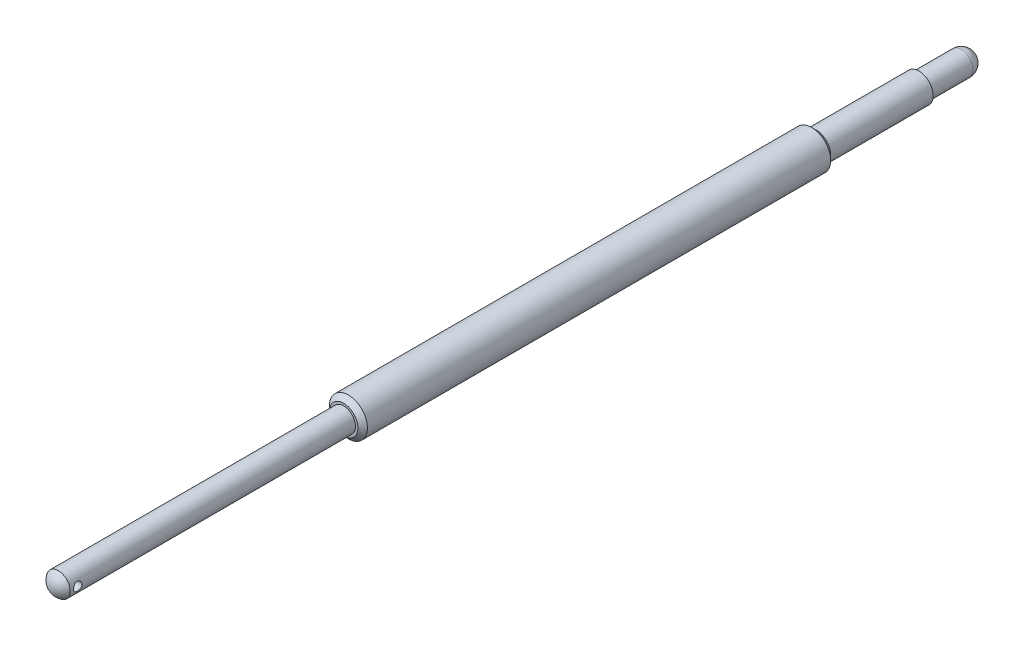
ISO-10303-21;
HEADER;
FILE_DESCRIPTION(('STEP AP214'),'2;1');
FILE_NAME('part.step','',(''),(''),'','','');
FILE_SCHEMA(('AUTOMOTIVE_DESIGN { 1 0 10303 214 1 1 1 1 }'));
ENDSEC;
DATA;
#1=APPLICATION_CONTEXT('core data for automotive mechanical design processes');
#2=APPLICATION_PROTOCOL_DEFINITION('international standard','automotive_design',2000,#1);
#3=PRODUCT_CONTEXT('',#1,'mechanical');
#4=PRODUCT('Part','Part','',(#3));
#5=PRODUCT_RELATED_PRODUCT_CATEGORY('part','',(#4));
#6=PRODUCT_DEFINITION_FORMATION('','',#4);
#7=PRODUCT_DEFINITION_CONTEXT('part definition',#1,'design');
#8=PRODUCT_DEFINITION('design','',#6,#7);
#9=PRODUCT_DEFINITION_SHAPE('','',#8);
#10=(LENGTH_UNIT() NAMED_UNIT(*) SI_UNIT(.MILLI.,.METRE.));
#11=(NAMED_UNIT(*) PLANE_ANGLE_UNIT() SI_UNIT($,.RADIAN.));
#12=(NAMED_UNIT(*) SI_UNIT($,.STERADIAN.) SOLID_ANGLE_UNIT());
#13=UNCERTAINTY_MEASURE_WITH_UNIT(LENGTH_MEASURE(1.E-05),#10,'distance_accuracy_value','');
#14=(GEOMETRIC_REPRESENTATION_CONTEXT(3) GLOBAL_UNCERTAINTY_ASSIGNED_CONTEXT((#13)) GLOBAL_UNIT_ASSIGNED_CONTEXT((#10,
#11,#12)) REPRESENTATION_CONTEXT('',''));
#15=CARTESIAN_POINT('',(0.,0.,0.));
#16=DIRECTION('',(0.,0.,1.));
#17=DIRECTION('',(1.,0.,0.));
#18=AXIS2_PLACEMENT_3D('',#15,#16,#17);
#19=CARTESIAN_POINT('',(0.,0.,29.2339285714286));
#20=DIRECTION('',(0.,0.,1.));
#21=DIRECTION('',(0.,1.,0.));
#22=AXIS2_PLACEMENT_3D('',#19,#20,#21);
#23=SPHERICAL_SURFACE('',#22,1.46607142857143);
#24=CARTESIAN_POINT('',(0.,0.,30.));
#25=DIRECTION('',(0.,0.,1.));
#26=DIRECTION('',(1.,0.,0.));
#27=AXIS2_PLACEMENT_3D('',#24,#25,#26);
#28=CIRCLE('',#27,1.25);
#29=CARTESIAN_POINT('',(1.25,0.,30.));
#30=VERTEX_POINT('',#29);
#31=EDGE_CURVE('E119',#30,#30,#28,.T.);
#32=ORIENTED_EDGE('',*,*,#31,.T.);
#33=EDGE_LOOP('',(#32));
#34=FACE_BOUND('',#33,.T.);
#35=ADVANCED_FACE('F37',(#34),#23,.T.);
#36=CARTESIAN_POINT('',(0.,0.,29.2339285714286));
#37=DIRECTION('',(0.,0.,1.));
#38=DIRECTION('',(1.,0.,0.));
#39=AXIS2_PLACEMENT_3D('',#36,#37,#38);
#40=CYLINDRICAL_SURFACE('',#39,1.25);
#41=CARTESIAN_POINT('',(1.25,0.,28.75));
#42=CARTESIAN_POINT('',(1.25000040723609,0.0244384751305164,28.7499994378276));
#43=CARTESIAN_POINT('',(1.24927693383174,0.0488729671488299,28.7519971248668));
#44=CARTESIAN_POINT('',(1.24646274613068,0.0970155173121452,28.7599057238524));
#45=CARTESIAN_POINT('',(1.24437210730604,0.120723615480875,28.7658164197878));
#46=CARTESIAN_POINT('',(1.23904903698493,0.166712324204668,28.7813174820519));
#47=CARTESIAN_POINT('',(1.23581870141066,0.188995467013132,28.7909010965917));
#48=CARTESIAN_POINT('',(1.22854090572765,0.231637065109007,28.8134430273575));
#49=CARTESIAN_POINT('',(1.2244932459972,0.251995048412089,28.8264021682404));
#50=CARTESIAN_POINT('',(1.21582249643607,0.291014704761408,28.8558644937571));
#51=CARTESIAN_POINT('',(1.2111840215262,0.309589863296305,28.8724776929282));
#52=CARTESIAN_POINT('',(1.20193335622081,0.343758835001425,28.9085429224733));
#53=CARTESIAN_POINT('',(1.19732117331175,0.359351836506441,28.9279957231797));
#54=CARTESIAN_POINT('',(1.18846998956649,0.387642687096019,28.9700083602702));
#55=CARTESIAN_POINT('',(1.18424937262762,0.400221982066126,28.9926522853473));
#56=CARTESIAN_POINT('',(1.17689655449398,0.421355714195511,29.0399105234912));
#57=CARTESIAN_POINT('',(1.17376395734842,0.429911615945029,29.0645241157384));
#58=CARTESIAN_POINT('',(1.16910541230589,0.442420401266971,29.1140309519151));
#59=CARTESIAN_POINT('',(1.16752240955865,0.446537363083646,29.1388771967946));
#60=CARTESIAN_POINT('',(1.16597459854696,0.450564482723503,29.1889543985149));
#61=CARTESIAN_POINT('',(1.1660091875151,0.450476207554875,29.2141852085505));
#62=CARTESIAN_POINT('',(1.16764315768912,0.44622152848196,29.2628536380879));
#63=CARTESIAN_POINT('',(1.16915721360065,0.442277492025171,29.286314080389));
#64=CARTESIAN_POINT('',(1.17343853021116,0.430789047499055,29.3322146765749));
#65=CARTESIAN_POINT('',(1.17620596479969,0.423244139849115,29.3546546884131));
#66=CARTESIAN_POINT('',(1.18273701623024,0.40463750761211,29.3983497926454));
#67=CARTESIAN_POINT('',(1.18651761729747,0.393515107315717,29.4195763978732));
#68=CARTESIAN_POINT('',(1.19464282278517,0.368111414259556,29.4599285988523));
#69=CARTESIAN_POINT('',(1.19898761055485,0.353829093523208,29.4790535078482));
#70=CARTESIAN_POINT('',(1.20807814726778,0.321474819154318,29.5158975383794));
#71=CARTESIAN_POINT('',(1.21283211547681,0.303223719437381,29.5334576783276));
#72=CARTESIAN_POINT('',(1.22197397595828,0.263979327970811,29.5653131732553));
#73=CARTESIAN_POINT('',(1.22636182040125,0.242985678857932,29.5796081020985));
#74=CARTESIAN_POINT('',(1.23435250383743,0.19847222797816,29.604684585905));
#75=CARTESIAN_POINT('',(1.23794416956984,0.174922636894472,29.6154170721114));
#76=CARTESIAN_POINT('',(1.24385568150711,0.126191129580164,29.6327164670057));
#77=CARTESIAN_POINT('',(1.24617604643873,0.101009883807999,29.639285074846));
#78=CARTESIAN_POINT('',(1.24919427583536,0.0510708468532371,29.647773601373));
#79=CARTESIAN_POINT('',(1.2499668844348,0.0263539673298414,29.6499078679819));
#80=CARTESIAN_POINT('',(1.25003098979485,-0.0230937505797712,29.6500862270546));
#81=CARTESIAN_POINT('',(1.2493227848467,-0.047824585151678,29.6481311432666));
#82=CARTESIAN_POINT('',(1.2465542310084,-0.0956974939355514,29.6403519031709));
#83=CARTESIAN_POINT('',(1.24454182742962,-0.118864903840725,29.6346648526896));
#84=CARTESIAN_POINT('',(1.23941514105771,-0.163903161679207,29.6197602295643));
#85=CARTESIAN_POINT('',(1.23630071506999,-0.185773840686505,29.6105421980989));
#86=CARTESIAN_POINT('',(1.22917069302151,-0.228292725849061,29.5885506218013));
#87=CARTESIAN_POINT('',(1.22513200678827,-0.248888543421395,29.5756834979693));
#88=CARTESIAN_POINT('',(1.21660467864307,-0.287695056299308,29.5468661825303));
#89=CARTESIAN_POINT('',(1.21211588067868,-0.305904919319065,29.5309149198698));
#90=CARTESIAN_POINT('',(1.20288780701601,-0.340437159411125,29.4953785877642));
#91=CARTESIAN_POINT('',(1.19814794682364,-0.35660696997101,29.4756450354927));
#92=CARTESIAN_POINT('',(1.18918923503224,-0.38543156016825,29.4336474342942));
#93=CARTESIAN_POINT('',(1.18497041195522,-0.398086147426711,29.4113832469661));
#94=CARTESIAN_POINT('',(1.17755963771346,-0.419502848931232,29.3648457172156));
#95=CARTESIAN_POINT('',(1.1743692500569,-0.428259044165972,29.3405693855468));
#96=CARTESIAN_POINT('',(1.16945344897398,-0.441508257865328,29.290741749571));
#97=CARTESIAN_POINT('',(1.1677272245445,-0.446003636567572,29.265191159394));
#98=CARTESIAN_POINT('',(1.16603733274694,-0.450401984829263,29.215178619576));
#99=CARTESIAN_POINT('',(1.16597482910249,-0.45056248443227,29.1907424458759));
#100=CARTESIAN_POINT('',(1.16736938466223,-0.446936699788748,29.1422111944486));
#101=CARTESIAN_POINT('',(1.16882632183067,-0.443150732507562,29.1181160894857));
#102=CARTESIAN_POINT('',(1.17301639751018,-0.431933687101611,29.0715802480714));
#103=CARTESIAN_POINT('',(1.17571550830545,-0.42459954784184,29.0491128276829));
#104=CARTESIAN_POINT('',(1.18206854191781,-0.406576951210559,29.0057123940045));
#105=CARTESIAN_POINT('',(1.18572269641268,-0.395887679812983,28.9847797546068));
#106=CARTESIAN_POINT('',(1.19379853976348,-0.370845022792183,28.9439217257789));
#107=CARTESIAN_POINT('',(1.198249198894,-0.356336898192084,28.9240969625188));
#108=CARTESIAN_POINT('',(1.20730930678499,-0.324315932234132,28.887080717396));
#109=CARTESIAN_POINT('',(1.21191880360763,-0.306802174916689,28.8698900412971));
#110=CARTESIAN_POINT('',(1.2210444364961,-0.268254928538434,28.8377872794059));
#111=CARTESIAN_POINT('',(1.22554532818551,-0.247092356574388,28.8230252189189));
#112=CARTESIAN_POINT('',(1.23370833099967,-0.202431213302635,28.7972770446774));
#113=CARTESIAN_POINT('',(1.23737048592701,-0.178932764076829,28.7862907337213));
#114=CARTESIAN_POINT('',(1.24346891087715,-0.129994305064539,28.7683903149976));
#115=CARTESIAN_POINT('',(1.24589215034614,-0.104536772886705,28.7615193674));
#116=CARTESIAN_POINT('',(1.24915715403535,-0.0527177016926036,28.7523254369654));
#117=CARTESIAN_POINT('',(1.24999956080189,-0.0263565344068856,28.7500006062947));
#118=CARTESIAN_POINT('',(1.25,0.,28.75));
#119=B_SPLINE_CURVE_WITH_KNOTS('',3,(#41,#42,#43,#44,#45,#46,#47,#48,#49,#50,#51,#52,#53,#54,
#55,#56,#57,#58,#59,#60,#61,#62,#63,#64,#65,#66,#67,#68,#69,#70,#71,#72,#73,#74,#75,#76,#77,#78,
#79,#80,#81,#82,#83,#84,#85,#86,#87,#88,#89,#90,#91,#92,#93,#94,#95,#96,#97,#98,#99,#100,#101,
#102,#103,#104,#105,#106,#107,#108,#109,#110,#111,#112,#113,#114,#115,#116,#117,#118),
.UNSPECIFIED.,.T.,.F.,(4,2,2,2,2,2,2,2,2,2,2,2,2,2,2,2,2,2,2,2,2,2,2,2,2,2,2,2,2,2,2,2,2,2,2,2,
2,2,4),(0.,0.0732182893614255,0.146432537171328,0.21951283856027,0.292611010580062,
0.36831902379005,0.444047613509014,0.522390971103224,0.600705788134358,0.676014536012452,
0.751295221619205,0.822475923261536,0.893666503302356,0.966134511965872,1.03862613047689,
1.11557965661002,1.19254322006218,1.2705266871562,1.34847831104277,1.42256484554476,
1.49663645768572,1.56812863156829,1.63963009841392,1.71316308695476,1.78672165789763,
1.86420534315489,1.94169326805466,2.01929844659833,2.09686061134522,2.16980407149288,
2.24274167354818,2.31379036584246,2.38485630939515,2.45942793642934,2.53402232948025,
2.61221708320134,2.69040775231132,2.76940471187616,2.84836955532329),.UNSPECIFIED.);
#120=CARTESIAN_POINT('',(1.25,0.,28.75));
#121=VERTEX_POINT('',#120);
#122=EDGE_CURVE('E41',#121,#121,#119,.T.);
#123=ORIENTED_EDGE('',*,*,#122,.F.);
#124=EDGE_LOOP('',(#123));
#125=FACE_BOUND('',#124,.T.);
#126=CARTESIAN_POINT('',(-1.25,0.,28.75));
#127=CARTESIAN_POINT('',(-1.25000040723609,-0.0244384751305164,28.7499994378276));
#128=CARTESIAN_POINT('',(-1.24927693383174,-0.0488729671488299,28.7519971248668));
#129=CARTESIAN_POINT('',(-1.24646274613068,-0.0970155173121452,28.7599057238524));
#130=CARTESIAN_POINT('',(-1.24437210730604,-0.120723615480875,28.7658164197878));
#131=CARTESIAN_POINT('',(-1.23904903698493,-0.166712324204668,28.7813174820519));
#132=CARTESIAN_POINT('',(-1.23581870141066,-0.188995467013132,28.7909010965917));
#133=CARTESIAN_POINT('',(-1.22854090572765,-0.231637065109007,28.8134430273575));
#134=CARTESIAN_POINT('',(-1.2244932459972,-0.251995048412089,28.8264021682404));
#135=CARTESIAN_POINT('',(-1.21582249643607,-0.291014704761408,28.8558644937571));
#136=CARTESIAN_POINT('',(-1.2111840215262,-0.309589863296305,28.8724776929282));
#137=CARTESIAN_POINT('',(-1.20193335622081,-0.343758835001425,28.9085429224733));
#138=CARTESIAN_POINT('',(-1.19732117331175,-0.359351836506441,28.9279957231797));
#139=CARTESIAN_POINT('',(-1.18846998956649,-0.387642687096019,28.9700083602702));
#140=CARTESIAN_POINT('',(-1.18424937262762,-0.400221982066126,28.9926522853473));
#141=CARTESIAN_POINT('',(-1.17689655449398,-0.421355714195511,29.0399105234912));
#142=CARTESIAN_POINT('',(-1.17376395734842,-0.429911615945029,29.0645241157384));
#143=CARTESIAN_POINT('',(-1.16910541230589,-0.442420401266971,29.1140309519151));
#144=CARTESIAN_POINT('',(-1.16752240955865,-0.446537363083646,29.1388771967946));
#145=CARTESIAN_POINT('',(-1.16597459854696,-0.450564482723503,29.1889543985149));
#146=CARTESIAN_POINT('',(-1.1660091875151,-0.450476207554875,29.2141852085505));
#147=CARTESIAN_POINT('',(-1.16764315768912,-0.44622152848196,29.2628536380879));
#148=CARTESIAN_POINT('',(-1.16915721360065,-0.442277492025171,29.286314080389));
#149=CARTESIAN_POINT('',(-1.17343853021116,-0.430789047499055,29.3322146765749));
#150=CARTESIAN_POINT('',(-1.17620596479969,-0.423244139849115,29.3546546884131));
#151=CARTESIAN_POINT('',(-1.18273701623024,-0.40463750761211,29.3983497926454));
#152=CARTESIAN_POINT('',(-1.18651761729747,-0.393515107315717,29.4195763978732));
#153=CARTESIAN_POINT('',(-1.19464282278517,-0.368111414259556,29.4599285988523));
#154=CARTESIAN_POINT('',(-1.19898761055485,-0.353829093523208,29.4790535078482));
#155=CARTESIAN_POINT('',(-1.20807814726778,-0.321474819154318,29.5158975383794));
#156=CARTESIAN_POINT('',(-1.21283211547681,-0.303223719437381,29.5334576783276));
#157=CARTESIAN_POINT('',(-1.22197397595828,-0.263979327970811,29.5653131732553));
#158=CARTESIAN_POINT('',(-1.22636182040125,-0.242985678857932,29.5796081020985));
#159=CARTESIAN_POINT('',(-1.23435250383743,-0.19847222797816,29.604684585905));
#160=CARTESIAN_POINT('',(-1.23794416956984,-0.174922636894472,29.6154170721114));
#161=CARTESIAN_POINT('',(-1.24385568150711,-0.126191129580164,29.6327164670057));
#162=CARTESIAN_POINT('',(-1.24617604643873,-0.101009883807999,29.639285074846));
#163=CARTESIAN_POINT('',(-1.24919427583536,-0.0510708468532371,29.647773601373));
#164=CARTESIAN_POINT('',(-1.2499668844348,-0.0263539673298414,29.6499078679819));
#165=CARTESIAN_POINT('',(-1.25003098979485,0.0230937505797712,29.6500862270546));
#166=CARTESIAN_POINT('',(-1.2493227848467,0.047824585151678,29.6481311432666));
#167=CARTESIAN_POINT('',(-1.2465542310084,0.0956974939355514,29.6403519031709));
#168=CARTESIAN_POINT('',(-1.24454182742962,0.118864903840725,29.6346648526896));
#169=CARTESIAN_POINT('',(-1.23941514105771,0.163903161679207,29.6197602295643));
#170=CARTESIAN_POINT('',(-1.23630071506999,0.185773840686505,29.6105421980989));
#171=CARTESIAN_POINT('',(-1.22917069302151,0.228292725849061,29.5885506218013));
#172=CARTESIAN_POINT('',(-1.22513200678827,0.248888543421395,29.5756834979693));
#173=CARTESIAN_POINT('',(-1.21660467864307,0.287695056299308,29.5468661825303));
#174=CARTESIAN_POINT('',(-1.21211588067868,0.305904919319065,29.5309149198698));
#175=CARTESIAN_POINT('',(-1.20288780701601,0.340437159411125,29.4953785877642));
#176=CARTESIAN_POINT('',(-1.19814794682364,0.35660696997101,29.4756450354927));
#177=CARTESIAN_POINT('',(-1.18918923503224,0.38543156016825,29.4336474342942));
#178=CARTESIAN_POINT('',(-1.18497041195522,0.398086147426711,29.4113832469661));
#179=CARTESIAN_POINT('',(-1.17755963771346,0.419502848931232,29.3648457172156));
#180=CARTESIAN_POINT('',(-1.1743692500569,0.428259044165972,29.3405693855468));
#181=CARTESIAN_POINT('',(-1.16945344897398,0.441508257865328,29.290741749571));
#182=CARTESIAN_POINT('',(-1.1677272245445,0.446003636567572,29.265191159394));
#183=CARTESIAN_POINT('',(-1.16603733274694,0.450401984829263,29.215178619576));
#184=CARTESIAN_POINT('',(-1.16597482910249,0.45056248443227,29.1907424458759));
#185=CARTESIAN_POINT('',(-1.16736938466223,0.446936699788748,29.1422111944486));
#186=CARTESIAN_POINT('',(-1.16882632183067,0.443150732507562,29.1181160894857));
#187=CARTESIAN_POINT('',(-1.17301639751018,0.431933687101611,29.0715802480714));
#188=CARTESIAN_POINT('',(-1.17571550830545,0.42459954784184,29.0491128276829));
#189=CARTESIAN_POINT('',(-1.18206854191781,0.406576951210559,29.0057123940045));
#190=CARTESIAN_POINT('',(-1.18572269641268,0.395887679812983,28.9847797546068));
#191=CARTESIAN_POINT('',(-1.19379853976348,0.370845022792183,28.9439217257789));
#192=CARTESIAN_POINT('',(-1.198249198894,0.356336898192084,28.9240969625188));
#193=CARTESIAN_POINT('',(-1.20730930678499,0.324315932234132,28.887080717396));
#194=CARTESIAN_POINT('',(-1.21191880360763,0.306802174916689,28.8698900412971));
#195=CARTESIAN_POINT('',(-1.2210444364961,0.268254928538434,28.8377872794059));
#196=CARTESIAN_POINT('',(-1.22554532818551,0.247092356574388,28.8230252189189));
#197=CARTESIAN_POINT('',(-1.23370833099967,0.202431213302635,28.7972770446774));
#198=CARTESIAN_POINT('',(-1.23737048592701,0.178932764076829,28.7862907337213));
#199=CARTESIAN_POINT('',(-1.24346891087715,0.129994305064539,28.7683903149976));
#200=CARTESIAN_POINT('',(-1.24589215034614,0.104536772886705,28.7615193674));
#201=CARTESIAN_POINT('',(-1.24915715403535,0.0527177016926036,28.7523254369654));
#202=CARTESIAN_POINT('',(-1.24999956080189,0.0263565344068856,28.7500006062947));
#203=CARTESIAN_POINT('',(-1.25,0.,28.75));
#204=B_SPLINE_CURVE_WITH_KNOTS('',3,(#126,#127,#128,#129,#130,#131,#132,#133,#134,#135,#136,
#137,#138,#139,#140,#141,#142,#143,#144,#145,#146,#147,#148,#149,#150,#151,#152,#153,#154,#155,
#156,#157,#158,#159,#160,#161,#162,#163,#164,#165,#166,#167,#168,#169,#170,#171,#172,#173,#174,
#175,#176,#177,#178,#179,#180,#181,#182,#183,#184,#185,#186,#187,#188,#189,#190,#191,#192,#193,
#194,#195,#196,#197,#198,#199,#200,#201,#202,#203),.UNSPECIFIED.,.T.,.F.,(4,2,2,2,2,2,2,2,2,2,2,
2,2,2,2,2,2,2,2,2,2,2,2,2,2,2,2,2,2,2,2,2,2,2,2,2,2,2,4),(0.,0.0732182893614255,
0.146432537171328,0.21951283856027,0.292611010580062,0.36831902379005,0.444047613509014,
0.522390971103224,0.600705788134358,0.676014536012452,0.751295221619205,0.822475923261536,
0.893666503302356,0.966134511965872,1.03862613047689,1.11557965661002,1.19254322006218,
1.2705266871562,1.34847831104277,1.42256484554476,1.49663645768572,1.56812863156829,
1.63963009841392,1.71316308695476,1.78672165789763,1.86420534315489,1.94169326805466,
2.01929844659833,2.09686061134522,2.16980407149288,2.24274167354818,2.31379036584246,
2.38485630939515,2.45942793642934,2.53402232948025,2.61221708320134,2.69040775231132,
2.76940471187616,2.84836955532329),.UNSPECIFIED.);
#205=CARTESIAN_POINT('',(-1.25,0.,28.75));
#206=VERTEX_POINT('',#205);
#207=EDGE_CURVE('E62',#206,#206,#204,.T.);
#208=ORIENTED_EDGE('',*,*,#207,.F.);
#209=EDGE_LOOP('',(#208));
#210=FACE_BOUND('',#209,.T.);
#211=CARTESIAN_POINT('',(0.,0.,0.));
#212=DIRECTION('',(0.,0.,1.));
#213=DIRECTION('',(1.,0.,0.));
#214=AXIS2_PLACEMENT_3D('',#211,#212,#213);
#215=CIRCLE('',#214,1.25);
#216=CARTESIAN_POINT('',(1.25,0.,0.));
#217=VERTEX_POINT('',#216);
#218=EDGE_CURVE('E122',#217,#217,#215,.T.);
#219=ORIENTED_EDGE('',*,*,#218,.T.);
#220=EDGE_LOOP('',(#219));
#221=FACE_BOUND('',#220,.T.);
#222=ORIENTED_EDGE('',*,*,#31,.F.);
#223=EDGE_LOOP('',(#222));
#224=FACE_BOUND('',#223,.T.);
#225=ADVANCED_FACE('F68',(#125,#210,#221,#224),#40,.T.);
#226=CARTESIAN_POINT('',(0.,-2.,0.));
#227=DIRECTION('',(0.,0.,1.));
#228=DIRECTION('',(1.,0.,0.));
#229=AXIS2_PLACEMENT_3D('',#226,#227,#228);
#230=PLANE('',#229);
#231=CARTESIAN_POINT('',(0.,0.,0.));
#232=DIRECTION('',(0.,0.,1.));
#233=DIRECTION('',(1.,0.,0.));
#234=AXIS2_PLACEMENT_3D('',#231,#232,#233);
#235=CIRCLE('',#234,1.50000000000002);
#236=CARTESIAN_POINT('',(1.50000000000002,0.,0.));
#237=VERTEX_POINT('',#236);
#238=EDGE_CURVE('E59',#237,#237,#235,.T.);
#239=ORIENTED_EDGE('',*,*,#238,.T.);
#240=EDGE_LOOP('',(#239));
#241=FACE_BOUND('',#240,.T.);
#242=ORIENTED_EDGE('',*,*,#218,.F.);
#243=EDGE_LOOP('',(#242));
#244=FACE_BOUND('',#243,.T.);
#245=ADVANCED_FACE('F97',(#241,#244),#230,.T.);
#246=CARTESIAN_POINT('',(0.,0.,29.2339285714286));
#247=DIRECTION('',(0.,0.,1.));
#248=DIRECTION('',(1.,0.,0.));
#249=AXIS2_PLACEMENT_3D('',#246,#247,#248);
#250=CYLINDRICAL_SURFACE('',#249,2.);
#251=CARTESIAN_POINT('',(0.,0.,-0.49999999999999));
#252=DIRECTION('',(0.,0.,1.));
#253=DIRECTION('',(1.,0.,0.));
#254=AXIS2_PLACEMENT_3D('',#251,#252,#253);
#255=CIRCLE('',#254,2.);
#256=CARTESIAN_POINT('',(2.,0.,-0.49999999999999));
#257=VERTEX_POINT('',#256);
#258=EDGE_CURVE('E10',#257,#257,#255,.F.);
#259=ORIENTED_EDGE('',*,*,#258,.T.);
#260=EDGE_LOOP('',(#259));
#261=FACE_BOUND('',#260,.T.);
#262=CARTESIAN_POINT('',(0.,0.,-49.2192259468306));
#263=DIRECTION('',(0.,0.,-1.));
#264=DIRECTION('',(-1.,0.,0.));
#265=AXIS2_PLACEMENT_3D('',#262,#263,#264);
#266=CIRCLE('',#265,2.);
#267=CARTESIAN_POINT('',(-2.,0.,-49.2192259468306));
#268=VERTEX_POINT('',#267);
#269=EDGE_CURVE('E51',#268,#268,#266,.F.);
#270=ORIENTED_EDGE('',*,*,#269,.T.);
#271=EDGE_LOOP('',(#270));
#272=FACE_BOUND('',#271,.T.);
#273=ADVANCED_FACE('F94',(#261,#272),#250,.T.);
#274=CARTESIAN_POINT('',(0.,0.,29.2339285714286));
#275=DIRECTION('',(0.,0.,1.));
#276=DIRECTION('',(1.,0.,0.));
#277=AXIS2_PLACEMENT_3D('',#274,#275,#276);
#278=CYLINDRICAL_SURFACE('',#277,1.5);
#279=CARTESIAN_POINT('',(0.,0.,-60.5));
#280=DIRECTION('',(0.,0.,1.));
#281=DIRECTION('',(1.,0.,0.));
#282=AXIS2_PLACEMENT_3D('',#279,#280,#281);
#283=CIRCLE('',#282,1.49999999999999);
#284=CARTESIAN_POINT('',(1.49999999999999,0.,-60.5));
#285=VERTEX_POINT('',#284);
#286=EDGE_CURVE('E131',#285,#285,#283,.T.);
#287=ORIENTED_EDGE('',*,*,#286,.T.);
#288=EDGE_LOOP('',(#287));
#289=FACE_BOUND('',#288,.T.);
#290=CARTESIAN_POINT('',(0.,0.,-49.7192259468306));
#291=DIRECTION('',(0.,0.,1.));
#292=DIRECTION('',(1.,0.,0.));
#293=AXIS2_PLACEMENT_3D('',#290,#291,#292);
#294=CIRCLE('',#293,1.5);
#295=CARTESIAN_POINT('',(1.5,0.,-49.7192259468306));
#296=VERTEX_POINT('',#295);
#297=EDGE_CURVE('E127',#296,#296,#294,.T.);
#298=ORIENTED_EDGE('',*,*,#297,.F.);
#299=EDGE_LOOP('',(#298));
#300=FACE_BOUND('',#299,.T.);
#301=ADVANCED_FACE('F90',(#289,#300),#278,.T.);
#302=CARTESIAN_POINT('',(0.,-1.25,-60.5));
#303=DIRECTION('',(0.,0.,-1.));
#304=DIRECTION('',(-1.,0.,0.));
#305=AXIS2_PLACEMENT_3D('',#302,#303,#304);
#306=PLANE('',#305);
#307=CARTESIAN_POINT('',(0.,0.,-60.5));
#308=DIRECTION('',(0.,0.,1.));
#309=DIRECTION('',(1.,0.,0.));
#310=AXIS2_PLACEMENT_3D('',#307,#308,#309);
#311=CIRCLE('',#310,1.25);
#312=CARTESIAN_POINT('',(1.25,0.,-60.5));
#313=VERTEX_POINT('',#312);
#314=EDGE_CURVE('E134',#313,#313,#311,.T.);
#315=ORIENTED_EDGE('',*,*,#314,.T.);
#316=EDGE_LOOP('',(#315));
#317=FACE_BOUND('',#316,.T.);
#318=ORIENTED_EDGE('',*,*,#286,.F.);
#319=EDGE_LOOP('',(#318));
#320=FACE_BOUND('',#319,.T.);
#321=ADVANCED_FACE('F86',(#317,#320),#306,.T.);
#322=CARTESIAN_POINT('',(0.,0.,29.2339285714286));
#323=DIRECTION('',(0.,0.,1.));
#324=DIRECTION('',(1.,0.,0.));
#325=AXIS2_PLACEMENT_3D('',#322,#323,#324);
#326=CYLINDRICAL_SURFACE('',#325,1.24999999999998);
#327=CARTESIAN_POINT('',(0.,0.,-64.9500000000001));
#328=DIRECTION('',(0.,0.,1.));
#329=DIRECTION('',(1.,0.,0.));
#330=AXIS2_PLACEMENT_3D('',#327,#328,#329);
#331=CIRCLE('',#330,1.24999999999996);
#332=CARTESIAN_POINT('',(1.24999999999996,0.,-64.9500000000001));
#333=VERTEX_POINT('',#332);
#334=EDGE_CURVE('E137',#333,#333,#331,.T.);
#335=ORIENTED_EDGE('',*,*,#334,.T.);
#336=EDGE_LOOP('',(#335));
#337=FACE_BOUND('',#336,.T.);
#338=ORIENTED_EDGE('',*,*,#314,.F.);
#339=EDGE_LOOP('',(#338));
#340=FACE_BOUND('',#339,.T.);
#341=ADVANCED_FACE('F82',(#337,#340),#326,.T.);
#342=CARTESIAN_POINT('',(0.,0.,-64.9500000000001));
#343=DIRECTION('',(0.,0.,1.));
#344=DIRECTION('',(0.,-1.,0.));
#345=AXIS2_PLACEMENT_3D('',#342,#343,#344);
#346=SPHERICAL_SURFACE('',#345,1.24999999999997);
#347=ORIENTED_EDGE('',*,*,#334,.F.);
#348=EDGE_LOOP('',(#347));
#349=FACE_BOUND('',#348,.T.);
#350=ADVANCED_FACE('F77',(#349),#346,.T.);
#351=CARTESIAN_POINT('',(0.,0.,0.));
#352=DIRECTION('',(0.,0.,-1.));
#353=DIRECTION('',(-1.,0.,0.));
#354=AXIS2_PLACEMENT_3D('',#351,#352,#353);
#355=CONICAL_SURFACE('',#354,1.50000000000002,0.785398163397443);
#356=ORIENTED_EDGE('',*,*,#258,.F.);
#357=EDGE_LOOP('',(#356));
#358=FACE_BOUND('',#357,.T.);
#359=ORIENTED_EDGE('',*,*,#238,.F.);
#360=EDGE_LOOP('',(#359));
#361=FACE_BOUND('',#360,.T.);
#362=ADVANCED_FACE('F81',(#358,#361),#355,.T.);
#363=CARTESIAN_POINT('',(0.,0.,-49.2192259468306));
#364=DIRECTION('',(0.,0.,1.));
#365=DIRECTION('',(1.,0.,0.));
#366=AXIS2_PLACEMENT_3D('',#363,#364,#365);
#367=CONICAL_SURFACE('',#366,2.,0.785398163397432);
#368=ORIENTED_EDGE('',*,*,#297,.T.);
#369=EDGE_LOOP('',(#368));
#370=FACE_BOUND('',#369,.T.);
#371=ORIENTED_EDGE('',*,*,#269,.F.);
#372=EDGE_LOOP('',(#371));
#373=FACE_BOUND('',#372,.T.);
#374=ADVANCED_FACE('F39',(#370,#373),#367,.T.);
#375=CARTESIAN_POINT('',(-2.,0.,29.2));
#376=DIRECTION('',(1.,0.,0.));
#377=DIRECTION('',(0.,0.,-1.));
#378=AXIS2_PLACEMENT_3D('',#375,#376,#377);
#379=CYLINDRICAL_SURFACE('',#378,0.449999999999998);
#380=ORIENTED_EDGE('',*,*,#122,.T.);
#381=EDGE_LOOP('',(#380));
#382=FACE_BOUND('',#381,.T.);
#383=ORIENTED_EDGE('',*,*,#207,.T.);
#384=EDGE_LOOP('',(#383));
#385=FACE_BOUND('',#384,.T.);
#386=ADVANCED_FACE('F72',(#382,#385),#379,.F.);
#387=CLOSED_SHELL('',(#35,#225,#245,#273,#301,#321,#341,#350,#362,#374,#386));
#388=MANIFOLD_SOLID_BREP('B2',#387);
#389=ADVANCED_BREP_SHAPE_REPRESENTATION('',(#18,#388),#14);
#390=SHAPE_DEFINITION_REPRESENTATION(#9,#389);
ENDSEC;
END-ISO-10303-21;
